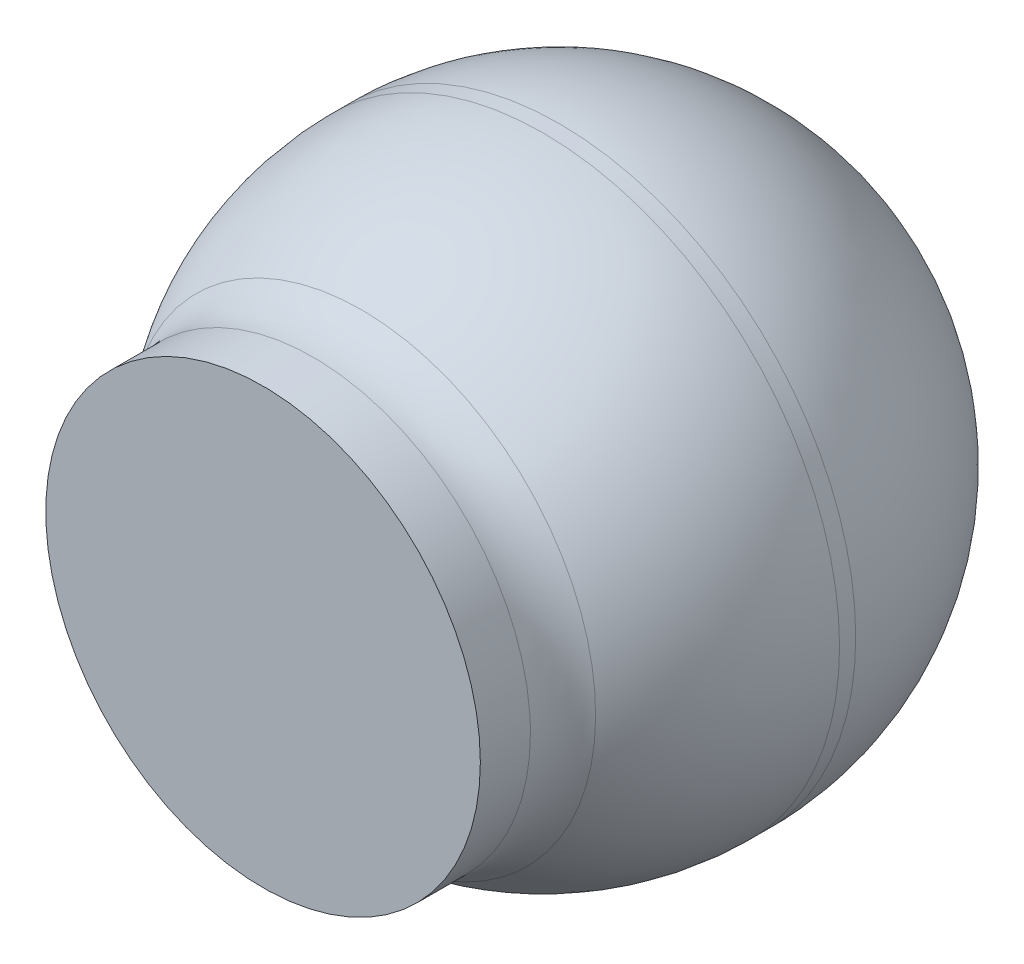
ISO-10303-21;
HEADER;
FILE_DESCRIPTION(('STEP AP214'),'2;1');
FILE_NAME('part.step','',(''),(''),'','','');
FILE_SCHEMA(('AUTOMOTIVE_DESIGN { 1 0 10303 214 1 1 1 1 }'));
ENDSEC;
DATA;
#1=APPLICATION_CONTEXT('core data for automotive mechanical design processes');
#2=APPLICATION_PROTOCOL_DEFINITION('international standard','automotive_design',2000,#1);
#3=PRODUCT_CONTEXT('',#1,'mechanical');
#4=PRODUCT('Part','Part','',(#3));
#5=PRODUCT_RELATED_PRODUCT_CATEGORY('part','',(#4));
#6=PRODUCT_DEFINITION_FORMATION('','',#4);
#7=PRODUCT_DEFINITION_CONTEXT('part definition',#1,'design');
#8=PRODUCT_DEFINITION('design','',#6,#7);
#9=PRODUCT_DEFINITION_SHAPE('','',#8);
#10=(LENGTH_UNIT() NAMED_UNIT(*) SI_UNIT(.MILLI.,.METRE.));
#11=(NAMED_UNIT(*) PLANE_ANGLE_UNIT() SI_UNIT($,.RADIAN.));
#12=(NAMED_UNIT(*) SI_UNIT($,.STERADIAN.) SOLID_ANGLE_UNIT());
#13=UNCERTAINTY_MEASURE_WITH_UNIT(LENGTH_MEASURE(1.E-05),#10,'distance_accuracy_value','');
#14=(GEOMETRIC_REPRESENTATION_CONTEXT(3) GLOBAL_UNCERTAINTY_ASSIGNED_CONTEXT((#13)) GLOBAL_UNIT_ASSIGNED_CONTEXT((#10,
#11,#12)) REPRESENTATION_CONTEXT('',''));
#15=CARTESIAN_POINT('',(0.,0.,0.));
#16=DIRECTION('',(0.,0.,1.));
#17=DIRECTION('',(1.,0.,0.));
#18=AXIS2_PLACEMENT_3D('',#15,#16,#17);
#19=CARTESIAN_POINT('',(-4.372919922269,-9.131349291452,10.006534503384));
#20=DIRECTION('',(0.,0.,-1.));
#21=DIRECTION('',(-1.,0.,0.));
#22=AXIS2_PLACEMENT_3D('',#19,#20,#21);
#23=PLANE('',#22);
#24=CARTESIAN_POINT('',(-4.372919922269,-9.131349291452,10.006534503384));
#25=DIRECTION('',(0.,0.,1.));
#26=DIRECTION('',(1.,0.,0.));
#27=AXIS2_PLACEMENT_3D('',#24,#25,#26);
#28=CIRCLE('',#27,0.275);
#29=CARTESIAN_POINT('',(-4.097919922269,-9.131349291452,10.006534503384));
#30=VERTEX_POINT('',#29);
#31=EDGE_CURVE('E20',#30,#30,#28,.F.);
#32=ORIENTED_EDGE('',*,*,#31,.F.);
#33=EDGE_LOOP('',(#32));
#34=FACE_BOUND('',#33,.T.);
#35=ADVANCED_FACE('F17',(#34),#23,.F.);
#36=CARTESIAN_POINT('',(-4.372919922269,-9.131349291452,9.906534503384));
#37=DIRECTION('',(0.,0.,1.));
#38=DIRECTION('',(1.,0.,0.));
#39=AXIS2_PLACEMENT_3D('',#36,#37,#38);
#40=CYLINDRICAL_SURFACE('',#39,0.275);
#41=CARTESIAN_POINT('',(-4.372919922269,-9.131349291452,9.943180457728));
#42=DIRECTION('',(0.,0.,-1.));
#43=DIRECTION('',(0.996700902337582,0.081162252799247,0.));
#44=AXIS2_PLACEMENT_3D('',#41,#42,#43);
#45=CIRCLE('',#44,0.275);
#46=CARTESIAN_POINT('',(-4.09882717412617,-9.10902967193221,9.943180457728));
#47=VERTEX_POINT('',#46);
#48=EDGE_CURVE('E65',#47,#47,#45,.F.);
#49=ORIENTED_EDGE('',*,*,#48,.T.);
#50=EDGE_LOOP('',(#49));
#51=FACE_BOUND('',#50,.T.);
#52=ORIENTED_EDGE('',*,*,#31,.T.);
#53=EDGE_LOOP('',(#52));
#54=FACE_BOUND('',#53,.T.);
#55=ADVANCED_FACE('F62',(#51,#54),#40,.T.);
#56=CARTESIAN_POINT('',(-4.372919922269,-9.131349291452,9.943180457728));
#57=DIRECTION('',(0.,0.,-1.));
#58=DIRECTION('',(0.996700902337583,0.0811622527992448,0.));
#59=AXIS2_PLACEMENT_3D('',#56,#57,#58);
#60=TOROIDAL_SURFACE('',#59,0.375,0.1);
#61=ORIENTED_EDGE('',*,*,#48,.F.);
#62=EDGE_LOOP('',(#61));
#63=FACE_BOUND('',#62,.T.);
#64=CARTESIAN_POINT('',(-4.372919922269,-9.131349291452,9.881744931236));
#65=DIRECTION('',(0.,0.,-1.));
#66=DIRECTION('',(-0.996700902337598,-0.0811622527990622,0.));
#67=AXIS2_PLACEMENT_3D('',#64,#65,#66);
#68=CIRCLE('',#67,0.296097046412665);
#69=CARTESIAN_POINT('',(-4.668040115608,-9.155381194786,9.881744931236));
#70=VERTEX_POINT('',#69);
#71=EDGE_CURVE('E39',#70,#70,#68,.T.);
#72=ORIENTED_EDGE('',*,*,#71,.F.);
#73=EDGE_LOOP('',(#72));
#74=FACE_BOUND('',#73,.T.);
#75=ADVANCED_FACE('F57',(#63,#74),#60,.F.);
#76=CARTESIAN_POINT('',(-4.746682760645,-9.161785136252,9.651976062157));
#77=CARTESIAN_POINT('',(-4.746682760645,-9.161785136252,9.701461392103));
#78=CARTESIAN_POINT('',(-4.738526217348,-9.161120941579,9.750947004335));
#79=CARTESIAN_POINT('',(-4.722207085349,-9.159792059952,9.798626332798));
#80=CARTESIAN_POINT('',(-4.698341390838,-9.157848654938,9.842699544317));
#81=CARTESIAN_POINT('',(-4.668040115608,-9.155381194786,9.881744931236));
#82=(BOUNDED_CURVE() B_SPLINE_CURVE(5,(#76,#77,#78,#79,#80,#81),.UNSPECIFIED.,.F.,
.F.) B_SPLINE_CURVE_WITH_KNOTS((6,6),(0.,0.661568582165),
.UNSPECIFIED.) CURVE() GEOMETRIC_REPRESENTATION_ITEM() RATIONAL_B_SPLINE_CURVE((1.,1.,1.,1.,1.,1.)) REPRESENTATION_ITEM(''));
#83=CARTESIAN_POINT('',(-4.372919922269,-9.131349291452,9.651976062157));
#84=DIRECTION('',(0.,0.,-1.));
#85=AXIS1_PLACEMENT('',#83,#84);
#86=SURFACE_OF_REVOLUTION('',#82,#85);
#87=CARTESIAN_POINT('',(-4.372919922269,-9.131349291452,9.651976062157));
#88=DIRECTION('',(0.,0.,1.));
#89=DIRECTION('',(1.,0.,0.));
#90=AXIS2_PLACEMENT_3D('',#87,#88,#89);
#91=CIRCLE('',#90,0.375);
#92=CARTESIAN_POINT('',(-3.997919922269,-9.131349291452,9.651976062157));
#93=VERTEX_POINT('',#92);
#94=EDGE_CURVE('E36',#93,#93,#91,.F.);
#95=ORIENTED_EDGE('',*,*,#94,.F.);
#96=EDGE_LOOP('',(#95));
#97=FACE_BOUND('',#96,.T.);
#98=ORIENTED_EDGE('',*,*,#71,.T.);
#99=EDGE_LOOP('',(#98));
#100=FACE_BOUND('',#99,.T.);
#101=ADVANCED_FACE('F53',(#97,#100),#86,.F.);
#102=CARTESIAN_POINT('',(-4.372919922269,-9.131349291452,9.256534503384));
#103=DIRECTION('',(0.,0.,1.));
#104=DIRECTION('',(1.,0.,0.));
#105=AXIS2_PLACEMENT_3D('',#102,#103,#104);
#106=CYLINDRICAL_SURFACE('',#105,0.375);
#107=CARTESIAN_POINT('',(-4.372919922269,-9.131349291452,9.631534503384));
#108=DIRECTION('',(0.,0.,-1.));
#109=DIRECTION('',(0.0811622527992357,-0.996700902337583,0.));
#110=AXIS2_PLACEMENT_3D('',#107,#108,#109);
#111=CIRCLE('',#110,0.375);
#112=CARTESIAN_POINT('',(-4.34248407746929,-9.50511212982859,9.631534503384));
#113=VERTEX_POINT('',#112);
#114=CARTESIAN_POINT('',(-4.40335576706871,-8.75758645307541,9.631534503384));
#115=VERTEX_POINT('',#114);
#116=EDGE_CURVE('E11',#113,#115,#111,.T.);
#117=ORIENTED_EDGE('',*,*,#116,.F.);
#118=CARTESIAN_POINT('',(-4.372919922269,-9.131349291452,9.631534503384));
#119=DIRECTION('',(3.33436315446763E-12,2.72100352061447E-13,1.));
#120=DIRECTION('',(0.0811622527992365,-0.996700902337583,0.));
#121=AXIS2_PLACEMENT_3D('',#118,#119,#120);
#122=CIRCLE('',#121,0.375);
#123=EDGE_CURVE('E25',#115,#113,#122,.F.);
#124=ORIENTED_EDGE('',*,*,#123,.F.);
#125=EDGE_LOOP('',(#117,#124));
#126=FACE_BOUND('',#125,.T.);
#127=ORIENTED_EDGE('',*,*,#94,.T.);
#128=EDGE_LOOP('',(#127));
#129=FACE_BOUND('',#128,.T.);
#130=ADVANCED_FACE('F34',(#126,#129),#106,.T.);
#131=CARTESIAN_POINT('',(-4.372919922269,-9.131349291452,9.631534503384));
#132=DIRECTION('',(0.0811622527992361,-0.996700902337583,0.));
#133=DIRECTION('',(-0.996700902337583,-0.0811622527992361,0.));
#134=AXIS2_PLACEMENT_3D('',#131,#132,#133);
#135=SPHERICAL_SURFACE('',#134,0.375);
#136=ORIENTED_EDGE('',*,*,#123,.T.);
#137=ORIENTED_EDGE('',*,*,#116,.T.);
#138=EDGE_LOOP('',(#136,#137));
#139=FACE_BOUND('',#138,.T.);
#140=ADVANCED_FACE('F32',(#139),#135,.T.);
#141=CLOSED_SHELL('',(#35,#55,#75,#101,#130,#140));
#142=MANIFOLD_SOLID_BREP('B1',#141);
#143=ADVANCED_BREP_SHAPE_REPRESENTATION('',(#18,#142),#14);
#144=SHAPE_DEFINITION_REPRESENTATION(#9,#143);
ENDSEC;
END-ISO-10303-21;
